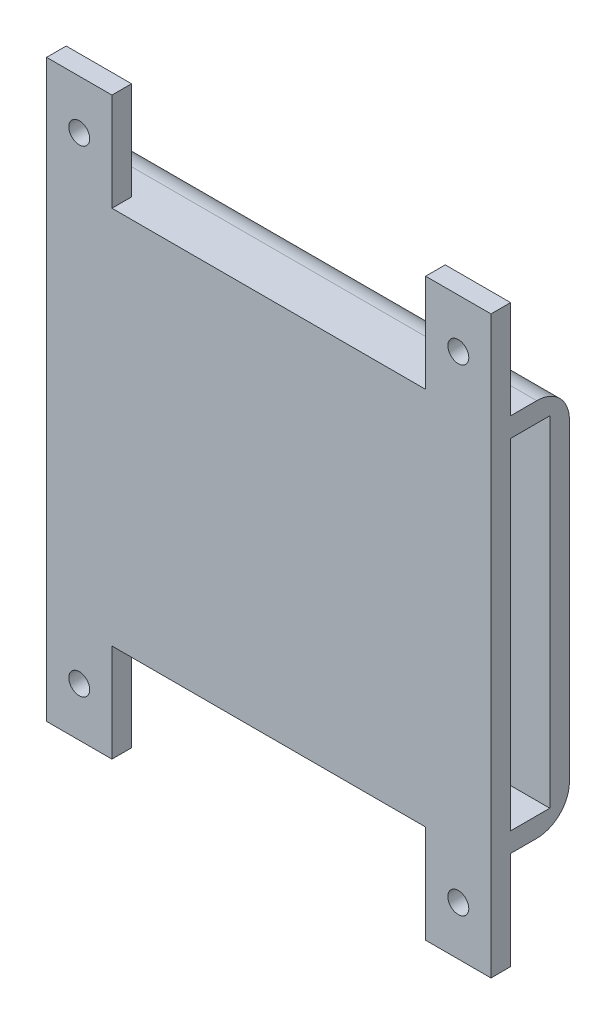
ISO-10303-21;
HEADER;
FILE_DESCRIPTION(('STEP AP214'),'2;1');
FILE_NAME('part.step','',(''),(''),'','','');
FILE_SCHEMA(('AUTOMOTIVE_DESIGN { 1 0 10303 214 1 1 1 1 }'));
ENDSEC;
DATA;
#1=APPLICATION_CONTEXT('core data for automotive mechanical design processes');
#2=APPLICATION_PROTOCOL_DEFINITION('international standard','automotive_design',2000,#1);
#3=PRODUCT_CONTEXT('',#1,'mechanical');
#4=PRODUCT('Part','Part','',(#3));
#5=PRODUCT_RELATED_PRODUCT_CATEGORY('part','',(#4));
#6=PRODUCT_DEFINITION_FORMATION('','',#4);
#7=PRODUCT_DEFINITION_CONTEXT('part definition',#1,'design');
#8=PRODUCT_DEFINITION('design','',#6,#7);
#9=PRODUCT_DEFINITION_SHAPE('','',#8);
#10=(LENGTH_UNIT() NAMED_UNIT(*) SI_UNIT(.MILLI.,.METRE.));
#11=(NAMED_UNIT(*) PLANE_ANGLE_UNIT() SI_UNIT($,.RADIAN.));
#12=(NAMED_UNIT(*) SI_UNIT($,.STERADIAN.) SOLID_ANGLE_UNIT());
#13=UNCERTAINTY_MEASURE_WITH_UNIT(LENGTH_MEASURE(1.E-05),#10,'distance_accuracy_value','');
#14=(GEOMETRIC_REPRESENTATION_CONTEXT(3) GLOBAL_UNCERTAINTY_ASSIGNED_CONTEXT((#13)) GLOBAL_UNIT_ASSIGNED_CONTEXT((#10,
#11,#12)) REPRESENTATION_CONTEXT('',''));
#15=CARTESIAN_POINT('',(0.,0.,0.));
#16=DIRECTION('',(0.,0.,1.));
#17=DIRECTION('',(1.,0.,0.));
#18=AXIS2_PLACEMENT_3D('',#15,#16,#17);
#19=CARTESIAN_POINT('',(-34.,-29.,3.));
#20=DIRECTION('',(0.,1.,0.));
#21=DIRECTION('',(0.,0.,1.));
#22=AXIS2_PLACEMENT_3D('',#19,#20,#21);
#23=PLANE('',#22);
#24=DIRECTION('',(0.,0.,-1.));
#25=VECTOR('',#24,1.);
#26=CARTESIAN_POINT('',(-34.,-29.,3.));
#27=LINE('',#26,#25);
#28=CARTESIAN_POINT('',(-34.,-29.,9.));
#29=VERTEX_POINT('',#28);
#30=CARTESIAN_POINT('',(-34.,-29.,5.));
#31=VERTEX_POINT('',#30);
#32=EDGE_CURVE('E354',#29,#31,#27,.T.);
#33=ORIENTED_EDGE('',*,*,#32,.T.);
#34=DIRECTION('',(1.,0.,0.));
#35=VECTOR('',#34,1.);
#36=CARTESIAN_POINT('',(-34.,-29.,5.));
#37=LINE('',#36,#35);
#38=CARTESIAN_POINT('',(34.,-29.,5.));
#39=VERTEX_POINT('',#38);
#40=EDGE_CURVE('E62',#31,#39,#37,.T.);
#41=ORIENTED_EDGE('',*,*,#40,.T.);
#42=DIRECTION('',(0.,0.,-1.));
#43=VECTOR('',#42,1.);
#44=CARTESIAN_POINT('',(34.,-29.,3.));
#45=LINE('',#44,#43);
#46=CARTESIAN_POINT('',(34.,-29.,9.));
#47=VERTEX_POINT('',#46);
#48=EDGE_CURVE('E351',#47,#39,#45,.T.);
#49=ORIENTED_EDGE('',*,*,#48,.F.);
#50=DIRECTION('',(1.,0.,0.));
#51=VECTOR('',#50,1.);
#52=CARTESIAN_POINT('',(34.,-29.,9.));
#53=LINE('',#52,#51);
#54=CARTESIAN_POINT('',(24.,-29.,9.));
#55=VERTEX_POINT('',#54);
#56=EDGE_CURVE('E281',#55,#47,#53,.T.);
#57=ORIENTED_EDGE('',*,*,#56,.F.);
#58=DIRECTION('',(0.,0.,-1.));
#59=VECTOR('',#58,1.);
#60=CARTESIAN_POINT('',(24.,-29.,12.));
#61=LINE('',#60,#59);
#62=CARTESIAN_POINT('',(24.,-29.,12.));
#63=VERTEX_POINT('',#62);
#64=EDGE_CURVE('E283',#63,#55,#61,.T.);
#65=ORIENTED_EDGE('',*,*,#64,.F.);
#66=DIRECTION('',(1.,0.,0.));
#67=VECTOR('',#66,1.);
#68=CARTESIAN_POINT('',(-34.,-29.,12.));
#69=LINE('',#68,#67);
#70=CARTESIAN_POINT('',(-24.,-29.,12.));
#71=VERTEX_POINT('',#70);
#72=EDGE_CURVE('E329',#71,#63,#69,.T.);
#73=ORIENTED_EDGE('',*,*,#72,.F.);
#74=DIRECTION('',(0.,0.,1.));
#75=VECTOR('',#74,1.);
#76=CARTESIAN_POINT('',(-24.,-29.,12.));
#77=LINE('',#76,#75);
#78=CARTESIAN_POINT('',(-24.,-29.,9.));
#79=VERTEX_POINT('',#78);
#80=EDGE_CURVE('E296',#79,#71,#77,.T.);
#81=ORIENTED_EDGE('',*,*,#80,.F.);
#82=DIRECTION('',(1.,0.,0.));
#83=VECTOR('',#82,1.);
#84=CARTESIAN_POINT('',(-34.,-29.,9.));
#85=LINE('',#84,#83);
#86=EDGE_CURVE('E285',#29,#79,#85,.T.);
#87=ORIENTED_EDGE('',*,*,#86,.F.);
#88=EDGE_LOOP('',(#33,#41,#49,#57,#65,#73,#81,#87));
#89=FACE_BOUND('',#88,.T.);
#90=ADVANCED_FACE('F37',(#89),#23,.F.);
#91=CARTESIAN_POINT('',(-31.,26.,12.));
#92=DIRECTION('',(0.,1.,0.));
#93=DIRECTION('',(0.,0.,1.));
#94=AXIS2_PLACEMENT_3D('',#91,#92,#93);
#95=PLANE('',#94);
#96=DIRECTION('',(-1.,0.,0.));
#97=VECTOR('',#96,1.);
#98=CARTESIAN_POINT('',(34.,26.,9.));
#99=LINE('',#98,#97);
#100=CARTESIAN_POINT('',(34.,26.,9.));
#101=VERTEX_POINT('',#100);
#102=CARTESIAN_POINT('',(-31.,26.,9.));
#103=VERTEX_POINT('',#102);
#104=EDGE_CURVE('E319',#101,#103,#99,.T.);
#105=ORIENTED_EDGE('',*,*,#104,.T.);
#106=DIRECTION('',(0.,0.,-1.));
#107=VECTOR('',#106,1.);
#108=CARTESIAN_POINT('',(-31.,26.,12.));
#109=LINE('',#108,#107);
#110=CARTESIAN_POINT('',(-31.,26.,3.));
#111=VERTEX_POINT('',#110);
#112=EDGE_CURVE('E332',#103,#111,#109,.T.);
#113=ORIENTED_EDGE('',*,*,#112,.T.);
#114=DIRECTION('',(1.,0.,0.));
#115=VECTOR('',#114,1.);
#116=CARTESIAN_POINT('',(-31.,26.,3.));
#117=LINE('',#116,#115);
#118=CARTESIAN_POINT('',(34.,26.,3.));
#119=VERTEX_POINT('',#118);
#120=EDGE_CURVE('E324',#111,#119,#117,.T.);
#121=ORIENTED_EDGE('',*,*,#120,.T.);
#122=DIRECTION('',(0.,0.,-1.));
#123=VECTOR('',#122,1.);
#124=CARTESIAN_POINT('',(34.,26.,12.));
#125=LINE('',#124,#123);
#126=EDGE_CURVE('E345',#101,#119,#125,.T.);
#127=ORIENTED_EDGE('',*,*,#126,.F.);
#128=EDGE_LOOP('',(#105,#113,#121,#127));
#129=FACE_BOUND('',#128,.T.);
#130=ADVANCED_FACE('F423',(#129),#95,.F.);
#131=CARTESIAN_POINT('',(34.,-26.,12.));
#132=DIRECTION('',(0.,-1.,0.));
#133=DIRECTION('',(1.,0.,0.));
#134=AXIS2_PLACEMENT_3D('',#131,#132,#133);
#135=PLANE('',#134);
#136=DIRECTION('',(-1.,0.,0.));
#137=VECTOR('',#136,1.);
#138=CARTESIAN_POINT('',(34.,-26.,8.99999999999999));
#139=LINE('',#138,#137);
#140=CARTESIAN_POINT('',(34.,-26.,8.99999999999999));
#141=VERTEX_POINT('',#140);
#142=CARTESIAN_POINT('',(-31.,-26.,8.99999999999999));
#143=VERTEX_POINT('',#142);
#144=EDGE_CURVE('E323',#141,#143,#139,.T.);
#145=ORIENTED_EDGE('',*,*,#144,.F.);
#146=DIRECTION('',(0.,0.,-1.));
#147=VECTOR('',#146,1.);
#148=CARTESIAN_POINT('',(34.,-26.,12.));
#149=LINE('',#148,#147);
#150=CARTESIAN_POINT('',(34.,-26.,3.));
#151=VERTEX_POINT('',#150);
#152=EDGE_CURVE('E343',#141,#151,#149,.T.);
#153=ORIENTED_EDGE('',*,*,#152,.T.);
#154=DIRECTION('',(-1.,0.,0.));
#155=VECTOR('',#154,1.);
#156=CARTESIAN_POINT('',(34.,-26.,3.));
#157=LINE('',#156,#155);
#158=CARTESIAN_POINT('',(-31.,-26.,3.));
#159=VERTEX_POINT('',#158);
#160=EDGE_CURVE('E335',#151,#159,#157,.T.);
#161=ORIENTED_EDGE('',*,*,#160,.T.);
#162=DIRECTION('',(0.,0.,-1.));
#163=VECTOR('',#162,1.);
#164=CARTESIAN_POINT('',(-31.,-26.,12.));
#165=LINE('',#164,#163);
#166=EDGE_CURVE('E341',#143,#159,#165,.T.);
#167=ORIENTED_EDGE('',*,*,#166,.F.);
#168=EDGE_LOOP('',(#145,#153,#161,#167));
#169=FACE_BOUND('',#168,.T.);
#170=ADVANCED_FACE('F428',(#169),#135,.F.);
#171=CARTESIAN_POINT('',(-31.,-26.,12.));
#172=DIRECTION('',(-1.,0.,0.));
#173=DIRECTION('',(0.,0.,1.));
#174=AXIS2_PLACEMENT_3D('',#171,#172,#173);
#175=PLANE('',#174);
#176=DIRECTION('',(0.,1.,0.));
#177=VECTOR('',#176,1.);
#178=CARTESIAN_POINT('',(-31.,26.,9.));
#179=LINE('',#178,#177);
#180=EDGE_CURVE('E316',#143,#103,#179,.T.);
#181=ORIENTED_EDGE('',*,*,#180,.F.);
#182=ORIENTED_EDGE('',*,*,#166,.T.);
#183=DIRECTION('',(0.,1.,0.));
#184=VECTOR('',#183,1.);
#185=CARTESIAN_POINT('',(-31.,-26.,3.));
#186=LINE('',#185,#184);
#187=EDGE_CURVE('E204',#159,#111,#186,.T.);
#188=ORIENTED_EDGE('',*,*,#187,.T.);
#189=ORIENTED_EDGE('',*,*,#112,.F.);
#190=EDGE_LOOP('',(#181,#182,#188,#189));
#191=FACE_BOUND('',#190,.T.);
#192=ADVANCED_FACE('F440',(#191),#175,.F.);
#193=CARTESIAN_POINT('',(34.,29.,3.));
#194=DIRECTION('',(-1.,0.,0.));
#195=DIRECTION('',(0.,-1.,0.));
#196=AXIS2_PLACEMENT_3D('',#193,#194,#195);
#197=PLANE('',#196);
#198=DIRECTION('',(0.,1.,0.));
#199=VECTOR('',#198,1.);
#200=CARTESIAN_POINT('',(34.,26.,9.));
#201=LINE('',#200,#199);
#202=EDGE_CURVE('E317',#141,#101,#201,.T.);
#203=ORIENTED_EDGE('',*,*,#202,.T.);
#204=ORIENTED_EDGE('',*,*,#126,.T.);
#205=DIRECTION('',(0.,1.,0.));
#206=VECTOR('',#205,1.);
#207=CARTESIAN_POINT('',(34.,29.,3.));
#208=LINE('',#207,#206);
#209=EDGE_CURVE('E348',#151,#119,#208,.T.);
#210=ORIENTED_EDGE('',*,*,#209,.F.);
#211=ORIENTED_EDGE('',*,*,#152,.F.);
#212=EDGE_LOOP('',(#203,#204,#210,#211));
#213=FACE_BOUND('',#212,.T.);
#214=ORIENTED_EDGE('',*,*,#48,.T.);
#215=CARTESIAN_POINT('',(34.,-24.,5.));
#216=DIRECTION('',(-1.,0.,0.));
#217=DIRECTION('',(0.,-1.,0.));
#218=AXIS2_PLACEMENT_3D('',#215,#216,#217);
#219=CIRCLE('',#218,5.);
#220=CARTESIAN_POINT('',(34.,-24.,0.));
#221=VERTEX_POINT('',#220);
#222=EDGE_CURVE('E46',#39,#221,#219,.F.);
#223=ORIENTED_EDGE('',*,*,#222,.T.);
#224=DIRECTION('',(0.,1.,0.));
#225=VECTOR('',#224,1.);
#226=CARTESIAN_POINT('',(34.,29.,0.));
#227=LINE('',#226,#225);
#228=CARTESIAN_POINT('',(34.,24.,0.));
#229=VERTEX_POINT('',#228);
#230=EDGE_CURVE('E347',#221,#229,#227,.T.);
#231=ORIENTED_EDGE('',*,*,#230,.T.);
#232=CARTESIAN_POINT('',(34.,24.,5.));
#233=DIRECTION('',(-1.,0.,0.));
#234=DIRECTION('',(0.,-1.,0.));
#235=AXIS2_PLACEMENT_3D('',#232,#233,#234);
#236=CIRCLE('',#235,5.);
#237=CARTESIAN_POINT('',(34.,29.,5.));
#238=VERTEX_POINT('',#237);
#239=EDGE_CURVE('E54',#229,#238,#236,.F.);
#240=ORIENTED_EDGE('',*,*,#239,.T.);
#241=DIRECTION('',(0.,0.,-1.));
#242=VECTOR('',#241,1.);
#243=CARTESIAN_POINT('',(34.,29.,3.));
#244=LINE('',#243,#242);
#245=CARTESIAN_POINT('',(34.,29.,9.));
#246=VERTEX_POINT('',#245);
#247=EDGE_CURVE('E359',#246,#238,#244,.T.);
#248=ORIENTED_EDGE('',*,*,#247,.F.);
#249=DIRECTION('',(0.,-1.,0.));
#250=VECTOR('',#249,1.);
#251=CARTESIAN_POINT('',(34.,44.,9.));
#252=LINE('',#251,#250);
#253=CARTESIAN_POINT('',(34.,44.,9.));
#254=VERTEX_POINT('',#253);
#255=EDGE_CURVE('E217',#254,#246,#252,.T.);
#256=ORIENTED_EDGE('',*,*,#255,.F.);
#257=DIRECTION('',(0.,0.,1.));
#258=VECTOR('',#257,1.);
#259=CARTESIAN_POINT('',(34.,44.,12.));
#260=LINE('',#259,#258);
#261=CARTESIAN_POINT('',(34.,44.,12.));
#262=VERTEX_POINT('',#261);
#263=EDGE_CURVE('E210',#254,#262,#260,.T.);
#264=ORIENTED_EDGE('',*,*,#263,.T.);
#265=DIRECTION('',(0.,1.,0.));
#266=VECTOR('',#265,1.);
#267=CARTESIAN_POINT('',(34.,26.,12.));
#268=LINE('',#267,#266);
#269=CARTESIAN_POINT('',(34.,-44.,12.));
#270=VERTEX_POINT('',#269);
#271=EDGE_CURVE('E191',#270,#262,#268,.T.);
#272=ORIENTED_EDGE('',*,*,#271,.F.);
#273=DIRECTION('',(0.,0.,1.));
#274=VECTOR('',#273,1.);
#275=CARTESIAN_POINT('',(34.,-44.,12.));
#276=LINE('',#275,#274);
#277=CARTESIAN_POINT('',(34.,-44.,9.));
#278=VERTEX_POINT('',#277);
#279=EDGE_CURVE('E280',#278,#270,#276,.T.);
#280=ORIENTED_EDGE('',*,*,#279,.F.);
#281=DIRECTION('',(0.,1.,0.));
#282=VECTOR('',#281,1.);
#283=CARTESIAN_POINT('',(34.,-44.,9.));
#284=LINE('',#283,#282);
#285=EDGE_CURVE('E277',#278,#47,#284,.T.);
#286=ORIENTED_EDGE('',*,*,#285,.T.);
#287=EDGE_LOOP('',(#214,#223,#231,#240,#248,#256,#264,#272,#280,#286));
#288=FACE_BOUND('',#287,.T.);
#289=ADVANCED_FACE('F216',(#213,#288),#197,.F.);
#290=CARTESIAN_POINT('',(-34.,29.,3.));
#291=DIRECTION('',(0.,-1.,0.));
#292=DIRECTION('',(0.,0.,-1.));
#293=AXIS2_PLACEMENT_3D('',#290,#291,#292);
#294=PLANE('',#293);
#295=ORIENTED_EDGE('',*,*,#247,.T.);
#296=DIRECTION('',(-1.,0.,0.));
#297=VECTOR('',#296,1.);
#298=CARTESIAN_POINT('',(-34.,29.,5.));
#299=LINE('',#298,#297);
#300=CARTESIAN_POINT('',(-34.,29.,5.));
#301=VERTEX_POINT('',#300);
#302=EDGE_CURVE('E11',#238,#301,#299,.T.);
#303=ORIENTED_EDGE('',*,*,#302,.T.);
#304=DIRECTION('',(0.,0.,-1.));
#305=VECTOR('',#304,1.);
#306=CARTESIAN_POINT('',(-34.,29.,3.));
#307=LINE('',#306,#305);
#308=CARTESIAN_POINT('',(-34.,29.,9.));
#309=VERTEX_POINT('',#308);
#310=EDGE_CURVE('E356',#309,#301,#307,.T.);
#311=ORIENTED_EDGE('',*,*,#310,.F.);
#312=DIRECTION('',(1.,0.,0.));
#313=VECTOR('',#312,1.);
#314=CARTESIAN_POINT('',(-34.,29.,9.));
#315=LINE('',#314,#313);
#316=CARTESIAN_POINT('',(-24.,29.,9.));
#317=VERTEX_POINT('',#316);
#318=EDGE_CURVE('E240',#309,#317,#315,.T.);
#319=ORIENTED_EDGE('',*,*,#318,.T.);
#320=DIRECTION('',(0.,0.,1.));
#321=VECTOR('',#320,1.);
#322=CARTESIAN_POINT('',(-24.,29.,12.));
#323=LINE('',#322,#321);
#324=CARTESIAN_POINT('',(-24.,29.,12.));
#325=VERTEX_POINT('',#324);
#326=EDGE_CURVE('E235',#317,#325,#323,.T.);
#327=ORIENTED_EDGE('',*,*,#326,.T.);
#328=DIRECTION('',(-1.,0.,0.));
#329=VECTOR('',#328,1.);
#330=CARTESIAN_POINT('',(34.,29.,12.));
#331=LINE('',#330,#329);
#332=CARTESIAN_POINT('',(24.,29.,12.));
#333=VERTEX_POINT('',#332);
#334=EDGE_CURVE('E203',#333,#325,#331,.T.);
#335=ORIENTED_EDGE('',*,*,#334,.F.);
#336=DIRECTION('',(0.,0.,-1.));
#337=VECTOR('',#336,1.);
#338=CARTESIAN_POINT('',(24.,29.,12.));
#339=LINE('',#338,#337);
#340=CARTESIAN_POINT('',(24.,29.,9.));
#341=VERTEX_POINT('',#340);
#342=EDGE_CURVE('E214',#333,#341,#339,.T.);
#343=ORIENTED_EDGE('',*,*,#342,.T.);
#344=DIRECTION('',(1.,0.,0.));
#345=VECTOR('',#344,1.);
#346=CARTESIAN_POINT('',(34.,29.,9.));
#347=LINE('',#346,#345);
#348=EDGE_CURVE('E225',#341,#246,#347,.T.);
#349=ORIENTED_EDGE('',*,*,#348,.T.);
#350=EDGE_LOOP('',(#295,#303,#311,#319,#327,#335,#343,#349));
#351=FACE_BOUND('',#350,.T.);
#352=ADVANCED_FACE('F406',(#351),#294,.F.);
#353=CARTESIAN_POINT('',(-34.,29.,3.));
#354=DIRECTION('',(1.,0.,0.));
#355=DIRECTION('',(0.,1.,0.));
#356=AXIS2_PLACEMENT_3D('',#353,#354,#355);
#357=PLANE('',#356);
#358=ORIENTED_EDGE('',*,*,#310,.T.);
#359=DIRECTION('',(0.,-1.,0.));
#360=VECTOR('',#359,1.);
#361=CARTESIAN_POINT('',(-34.,29.,5.));
#362=LINE('',#361,#360);
#363=EDGE_CURVE('E361',#301,#31,#362,.T.);
#364=ORIENTED_EDGE('',*,*,#363,.T.);
#365=ORIENTED_EDGE('',*,*,#32,.F.);
#366=DIRECTION('',(0.,1.,0.));
#367=VECTOR('',#366,1.);
#368=CARTESIAN_POINT('',(-34.,-44.,9.));
#369=LINE('',#368,#367);
#370=CARTESIAN_POINT('',(-34.,-44.,9.));
#371=VERTEX_POINT('',#370);
#372=EDGE_CURVE('E313',#371,#29,#369,.T.);
#373=ORIENTED_EDGE('',*,*,#372,.F.);
#374=DIRECTION('',(0.,0.,-1.));
#375=VECTOR('',#374,1.);
#376=CARTESIAN_POINT('',(-34.,-44.,12.));
#377=LINE('',#376,#375);
#378=CARTESIAN_POINT('',(-34.,-44.,12.));
#379=VERTEX_POINT('',#378);
#380=EDGE_CURVE('E292',#379,#371,#377,.T.);
#381=ORIENTED_EDGE('',*,*,#380,.F.);
#382=DIRECTION('',(0.,-1.,0.));
#383=VECTOR('',#382,1.);
#384=CARTESIAN_POINT('',(-34.,29.,12.));
#385=LINE('',#384,#383);
#386=CARTESIAN_POINT('',(-34.,44.,12.));
#387=VERTEX_POINT('',#386);
#388=EDGE_CURVE('E327',#387,#379,#385,.T.);
#389=ORIENTED_EDGE('',*,*,#388,.F.);
#390=DIRECTION('',(0.,0.,-1.));
#391=VECTOR('',#390,1.);
#392=CARTESIAN_POINT('',(-34.,44.,12.));
#393=LINE('',#392,#391);
#394=CARTESIAN_POINT('',(-34.,44.,9.));
#395=VERTEX_POINT('',#394);
#396=EDGE_CURVE('E236',#387,#395,#393,.T.);
#397=ORIENTED_EDGE('',*,*,#396,.T.);
#398=DIRECTION('',(0.,-1.,0.));
#399=VECTOR('',#398,1.);
#400=CARTESIAN_POINT('',(-34.,44.,9.));
#401=LINE('',#400,#399);
#402=EDGE_CURVE('E249',#395,#309,#401,.T.);
#403=ORIENTED_EDGE('',*,*,#402,.T.);
#404=EDGE_LOOP('',(#358,#364,#365,#373,#381,#389,#397,#403));
#405=FACE_BOUND('',#404,.T.);
#406=ADVANCED_FACE('F409',(#405),#357,.F.);
#407=CARTESIAN_POINT('',(0.,0.,3.));
#408=DIRECTION('',(0.,0.,1.));
#409=DIRECTION('',(1.,0.,0.));
#410=AXIS2_PLACEMENT_3D('',#407,#408,#409);
#411=PLANE('',#410);
#412=ORIENTED_EDGE('',*,*,#120,.F.);
#413=ORIENTED_EDGE('',*,*,#187,.F.);
#414=ORIENTED_EDGE('',*,*,#160,.F.);
#415=ORIENTED_EDGE('',*,*,#209,.T.);
#416=EDGE_LOOP('',(#412,#413,#414,#415));
#417=FACE_BOUND('',#416,.T.);
#418=ADVANCED_FACE('F437',(#417),#411,.T.);
#419=CARTESIAN_POINT('',(0.,0.,0.));
#420=DIRECTION('',(0.,0.,1.));
#421=DIRECTION('',(1.,0.,0.));
#422=AXIS2_PLACEMENT_3D('',#419,#420,#421);
#423=PLANE('',#422);
#424=ORIENTED_EDGE('',*,*,#230,.F.);
#425=DIRECTION('',(1.,0.,0.));
#426=VECTOR('',#425,1.);
#427=CARTESIAN_POINT('',(0.,-24.,0.));
#428=LINE('',#427,#426);
#429=CARTESIAN_POINT('',(-29.,-24.,0.));
#430=VERTEX_POINT('',#429);
#431=EDGE_CURVE('E368',#221,#430,#428,.F.);
#432=ORIENTED_EDGE('',*,*,#431,.T.);
#433=DIRECTION('',(0.,-1.,0.));
#434=VECTOR('',#433,1.);
#435=CARTESIAN_POINT('',(-29.,0.,0.));
#436=LINE('',#435,#434);
#437=CARTESIAN_POINT('',(-29.,24.,0.));
#438=VERTEX_POINT('',#437);
#439=EDGE_CURVE('E366',#430,#438,#436,.F.);
#440=ORIENTED_EDGE('',*,*,#439,.T.);
#441=DIRECTION('',(-1.,0.,0.));
#442=VECTOR('',#441,1.);
#443=CARTESIAN_POINT('',(0.,24.,0.));
#444=LINE('',#443,#442);
#445=EDGE_CURVE('E364',#438,#229,#444,.F.);
#446=ORIENTED_EDGE('',*,*,#445,.T.);
#447=EDGE_LOOP('',(#424,#432,#440,#446));
#448=FACE_BOUND('',#447,.T.);
#449=ADVANCED_FACE('F433',(#448),#423,.F.);
#450=CARTESIAN_POINT('',(0.,0.,12.));
#451=DIRECTION('',(0.,0.,1.));
#452=DIRECTION('',(1.,0.,0.));
#453=AXIS2_PLACEMENT_3D('',#450,#451,#452);
#454=PLANE('',#453);
#455=CARTESIAN_POINT('',(-29.,36.5,12.));
#456=DIRECTION('',(0.,0.,-1.));
#457=DIRECTION('',(1.,0.,0.));
#458=AXIS2_PLACEMENT_3D('',#455,#456,#457);
#459=CIRCLE('',#458,1.6);
#460=CARTESIAN_POINT('',(-27.4,36.5,12.));
#461=VERTEX_POINT('',#460);
#462=EDGE_CURVE('E385',#461,#461,#459,.T.);
#463=ORIENTED_EDGE('',*,*,#462,.T.);
#464=EDGE_LOOP('',(#463));
#465=FACE_BOUND('',#464,.T.);
#466=CARTESIAN_POINT('',(29.,36.5,12.));
#467=DIRECTION('',(0.,0.,-1.));
#468=DIRECTION('',(-1.,0.,0.));
#469=AXIS2_PLACEMENT_3D('',#466,#467,#468);
#470=CIRCLE('',#469,1.6);
#471=CARTESIAN_POINT('',(27.4,36.5,12.));
#472=VERTEX_POINT('',#471);
#473=EDGE_CURVE('E378',#472,#472,#470,.T.);
#474=ORIENTED_EDGE('',*,*,#473,.T.);
#475=EDGE_LOOP('',(#474));
#476=FACE_BOUND('',#475,.T.);
#477=CARTESIAN_POINT('',(-29.,-36.5,12.));
#478=DIRECTION('',(0.,0.,1.));
#479=DIRECTION('',(1.,0.,0.));
#480=AXIS2_PLACEMENT_3D('',#477,#478,#479);
#481=CIRCLE('',#480,1.6);
#482=CARTESIAN_POINT('',(-27.4,-36.5,12.));
#483=VERTEX_POINT('',#482);
#484=EDGE_CURVE('E265',#483,#483,#481,.T.);
#485=ORIENTED_EDGE('',*,*,#484,.F.);
#486=EDGE_LOOP('',(#485));
#487=FACE_BOUND('',#486,.T.);
#488=CARTESIAN_POINT('',(29.,-36.5,12.));
#489=DIRECTION('',(0.,0.,1.));
#490=DIRECTION('',(-1.,0.,0.));
#491=AXIS2_PLACEMENT_3D('',#488,#489,#490);
#492=CIRCLE('',#491,1.6);
#493=CARTESIAN_POINT('',(27.4,-36.5,12.));
#494=VERTEX_POINT('',#493);
#495=EDGE_CURVE('E268',#494,#494,#492,.T.);
#496=ORIENTED_EDGE('',*,*,#495,.F.);
#497=EDGE_LOOP('',(#496));
#498=FACE_BOUND('',#497,.T.);
#499=ORIENTED_EDGE('',*,*,#388,.T.);
#500=DIRECTION('',(-1.,0.,0.));
#501=VECTOR('',#500,1.);
#502=CARTESIAN_POINT('',(-34.,-44.,12.));
#503=LINE('',#502,#501);
#504=CARTESIAN_POINT('',(-24.,-44.,12.));
#505=VERTEX_POINT('',#504);
#506=EDGE_CURVE('E300',#505,#379,#503,.T.);
#507=ORIENTED_EDGE('',*,*,#506,.F.);
#508=DIRECTION('',(0.,1.,0.));
#509=VECTOR('',#508,1.);
#510=CARTESIAN_POINT('',(-24.,-44.,12.));
#511=LINE('',#510,#509);
#512=EDGE_CURVE('E303',#505,#71,#511,.T.);
#513=ORIENTED_EDGE('',*,*,#512,.T.);
#514=ORIENTED_EDGE('',*,*,#72,.T.);
#515=DIRECTION('',(0.,1.,0.));
#516=VECTOR('',#515,1.);
#517=CARTESIAN_POINT('',(24.,-44.,12.));
#518=LINE('',#517,#516);
#519=CARTESIAN_POINT('',(24.,-44.,12.));
#520=VERTEX_POINT('',#519);
#521=EDGE_CURVE('E264',#520,#63,#518,.T.);
#522=ORIENTED_EDGE('',*,*,#521,.F.);
#523=DIRECTION('',(-1.,0.,0.));
#524=VECTOR('',#523,1.);
#525=CARTESIAN_POINT('',(34.,-44.,12.));
#526=LINE('',#525,#524);
#527=EDGE_CURVE('E199',#270,#520,#526,.T.);
#528=ORIENTED_EDGE('',*,*,#527,.F.);
#529=ORIENTED_EDGE('',*,*,#271,.T.);
#530=DIRECTION('',(-1.,0.,0.));
#531=VECTOR('',#530,1.);
#532=CARTESIAN_POINT('',(34.,44.,12.));
#533=LINE('',#532,#531);
#534=CARTESIAN_POINT('',(24.,44.,12.));
#535=VERTEX_POINT('',#534);
#536=EDGE_CURVE('E195',#262,#535,#533,.T.);
#537=ORIENTED_EDGE('',*,*,#536,.T.);
#538=DIRECTION('',(0.,-1.,0.));
#539=VECTOR('',#538,1.);
#540=CARTESIAN_POINT('',(24.,44.,12.));
#541=LINE('',#540,#539);
#542=EDGE_CURVE('E224',#535,#333,#541,.T.);
#543=ORIENTED_EDGE('',*,*,#542,.T.);
#544=ORIENTED_EDGE('',*,*,#334,.T.);
#545=DIRECTION('',(0.,-1.,0.));
#546=VECTOR('',#545,1.);
#547=CARTESIAN_POINT('',(-24.,44.,12.));
#548=LINE('',#547,#546);
#549=CARTESIAN_POINT('',(-24.,44.,12.));
#550=VERTEX_POINT('',#549);
#551=EDGE_CURVE('E257',#550,#325,#548,.T.);
#552=ORIENTED_EDGE('',*,*,#551,.F.);
#553=DIRECTION('',(-1.,0.,0.));
#554=VECTOR('',#553,1.);
#555=CARTESIAN_POINT('',(-34.,44.,12.));
#556=LINE('',#555,#554);
#557=EDGE_CURVE('E239',#550,#387,#556,.T.);
#558=ORIENTED_EDGE('',*,*,#557,.T.);
#559=EDGE_LOOP('',(#499,#507,#513,#514,#522,#528,#529,#537,#543,#544,#552,#558));
#560=FACE_BOUND('',#559,.T.);
#561=ADVANCED_FACE('F193',(#465,#476,#487,#498,#560),#454,.T.);
#562=CARTESIAN_POINT('',(34.,26.,9.));
#563=DIRECTION('',(0.,0.,1.));
#564=DIRECTION('',(0.,-1.,0.));
#565=AXIS2_PLACEMENT_3D('',#562,#563,#564);
#566=PLANE('',#565);
#567=ORIENTED_EDGE('',*,*,#180,.T.);
#568=ORIENTED_EDGE('',*,*,#104,.F.);
#569=ORIENTED_EDGE('',*,*,#202,.F.);
#570=ORIENTED_EDGE('',*,*,#144,.T.);
#571=EDGE_LOOP('',(#567,#568,#569,#570));
#572=FACE_BOUND('',#571,.T.);
#573=ADVANCED_FACE('F453',(#572),#566,.F.);
#574=CARTESIAN_POINT('',(-34.,-44.,9.));
#575=DIRECTION('',(0.,0.,1.));
#576=DIRECTION('',(1.,0.,0.));
#577=AXIS2_PLACEMENT_3D('',#574,#575,#576);
#578=PLANE('',#577);
#579=CARTESIAN_POINT('',(-29.,-36.5,9.));
#580=DIRECTION('',(0.,0.,1.));
#581=DIRECTION('',(1.,0.,0.));
#582=AXIS2_PLACEMENT_3D('',#579,#580,#581);
#583=CIRCLE('',#582,1.6);
#584=CARTESIAN_POINT('',(-27.4,-36.5,9.));
#585=VERTEX_POINT('',#584);
#586=EDGE_CURVE('E261',#585,#585,#583,.T.);
#587=ORIENTED_EDGE('',*,*,#586,.T.);
#588=EDGE_LOOP('',(#587));
#589=FACE_BOUND('',#588,.T.);
#590=ORIENTED_EDGE('',*,*,#86,.T.);
#591=DIRECTION('',(0.,1.,0.));
#592=VECTOR('',#591,1.);
#593=CARTESIAN_POINT('',(-24.,-44.,9.));
#594=LINE('',#593,#592);
#595=CARTESIAN_POINT('',(-24.,-44.,9.));
#596=VERTEX_POINT('',#595);
#597=EDGE_CURVE('E310',#596,#79,#594,.T.);
#598=ORIENTED_EDGE('',*,*,#597,.F.);
#599=DIRECTION('',(1.,0.,0.));
#600=VECTOR('',#599,1.);
#601=CARTESIAN_POINT('',(-34.,-44.,9.));
#602=LINE('',#601,#600);
#603=EDGE_CURVE('E295',#371,#596,#602,.T.);
#604=ORIENTED_EDGE('',*,*,#603,.F.);
#605=ORIENTED_EDGE('',*,*,#372,.T.);
#606=EDGE_LOOP('',(#590,#598,#604,#605));
#607=FACE_BOUND('',#606,.T.);
#608=ADVANCED_FACE('F495',(#589,#607),#578,.F.);
#609=CARTESIAN_POINT('',(-24.,-44.,12.));
#610=DIRECTION('',(-1.,0.,0.));
#611=DIRECTION('',(0.,0.,1.));
#612=AXIS2_PLACEMENT_3D('',#609,#610,#611);
#613=PLANE('',#612);
#614=ORIENTED_EDGE('',*,*,#80,.T.);
#615=ORIENTED_EDGE('',*,*,#512,.F.);
#616=DIRECTION('',(0.,0.,1.));
#617=VECTOR('',#616,1.);
#618=CARTESIAN_POINT('',(-24.,-44.,12.));
#619=LINE('',#618,#617);
#620=EDGE_CURVE('E298',#596,#505,#619,.T.);
#621=ORIENTED_EDGE('',*,*,#620,.F.);
#622=ORIENTED_EDGE('',*,*,#597,.T.);
#623=EDGE_LOOP('',(#614,#615,#621,#622));
#624=FACE_BOUND('',#623,.T.);
#625=ADVANCED_FACE('F491',(#624),#613,.F.);
#626=CARTESIAN_POINT('',(0.,-44.,0.));
#627=DIRECTION('',(0.,-1.,0.));
#628=DIRECTION('',(0.,0.,-1.));
#629=AXIS2_PLACEMENT_3D('',#626,#627,#628);
#630=PLANE('',#629);
#631=ORIENTED_EDGE('',*,*,#380,.T.);
#632=ORIENTED_EDGE('',*,*,#603,.T.);
#633=ORIENTED_EDGE('',*,*,#620,.T.);
#634=ORIENTED_EDGE('',*,*,#506,.T.);
#635=EDGE_LOOP('',(#631,#632,#633,#634));
#636=FACE_BOUND('',#635,.T.);
#637=ADVANCED_FACE('F500',(#636),#630,.T.);
#638=CARTESIAN_POINT('',(24.,-44.,12.));
#639=DIRECTION('',(1.,0.,0.));
#640=DIRECTION('',(0.,0.,-1.));
#641=AXIS2_PLACEMENT_3D('',#638,#639,#640);
#642=PLANE('',#641);
#643=ORIENTED_EDGE('',*,*,#64,.T.);
#644=DIRECTION('',(0.,1.,0.));
#645=VECTOR('',#644,1.);
#646=CARTESIAN_POINT('',(24.,-44.,9.));
#647=LINE('',#646,#645);
#648=CARTESIAN_POINT('',(24.,-44.,9.));
#649=VERTEX_POINT('',#648);
#650=EDGE_CURVE('E274',#649,#55,#647,.T.);
#651=ORIENTED_EDGE('',*,*,#650,.F.);
#652=DIRECTION('',(0.,0.,-1.));
#653=VECTOR('',#652,1.);
#654=CARTESIAN_POINT('',(24.,-44.,12.));
#655=LINE('',#654,#653);
#656=EDGE_CURVE('E289',#520,#649,#655,.T.);
#657=ORIENTED_EDGE('',*,*,#656,.F.);
#658=ORIENTED_EDGE('',*,*,#521,.T.);
#659=EDGE_LOOP('',(#643,#651,#657,#658));
#660=FACE_BOUND('',#659,.T.);
#661=ADVANCED_FACE('F487',(#660),#642,.F.);
#662=CARTESIAN_POINT('',(34.,-44.,9.));
#663=DIRECTION('',(0.,0.,1.));
#664=DIRECTION('',(1.,0.,0.));
#665=AXIS2_PLACEMENT_3D('',#662,#663,#664);
#666=PLANE('',#665);
#667=CARTESIAN_POINT('',(29.,-36.5,9.));
#668=DIRECTION('',(0.,0.,1.));
#669=DIRECTION('',(-1.,0.,0.));
#670=AXIS2_PLACEMENT_3D('',#667,#668,#669);
#671=CIRCLE('',#670,1.6);
#672=CARTESIAN_POINT('',(27.4,-36.5,9.));
#673=VERTEX_POINT('',#672);
#674=EDGE_CURVE('E260',#673,#673,#671,.T.);
#675=ORIENTED_EDGE('',*,*,#674,.T.);
#676=EDGE_LOOP('',(#675));
#677=FACE_BOUND('',#676,.T.);
#678=ORIENTED_EDGE('',*,*,#56,.T.);
#679=ORIENTED_EDGE('',*,*,#285,.F.);
#680=DIRECTION('',(1.,0.,0.));
#681=VECTOR('',#680,1.);
#682=CARTESIAN_POINT('',(34.,-44.,9.));
#683=LINE('',#682,#681);
#684=EDGE_CURVE('E287',#649,#278,#683,.T.);
#685=ORIENTED_EDGE('',*,*,#684,.F.);
#686=ORIENTED_EDGE('',*,*,#650,.T.);
#687=EDGE_LOOP('',(#678,#679,#685,#686));
#688=FACE_BOUND('',#687,.T.);
#689=ADVANCED_FACE('F483',(#677,#688),#666,.F.);
#690=CARTESIAN_POINT('',(0.,-44.,0.));
#691=DIRECTION('',(0.,-1.,0.));
#692=DIRECTION('',(0.,0.,-1.));
#693=AXIS2_PLACEMENT_3D('',#690,#691,#692);
#694=PLANE('',#693);
#695=ORIENTED_EDGE('',*,*,#527,.T.);
#696=ORIENTED_EDGE('',*,*,#656,.T.);
#697=ORIENTED_EDGE('',*,*,#684,.T.);
#698=ORIENTED_EDGE('',*,*,#279,.T.);
#699=EDGE_LOOP('',(#695,#696,#697,#698));
#700=FACE_BOUND('',#699,.T.);
#701=ADVANCED_FACE('F533',(#700),#694,.T.);
#702=CARTESIAN_POINT('',(29.,-36.5,9.));
#703=DIRECTION('',(0.,0.,1.));
#704=DIRECTION('',(1.,0.,0.));
#705=AXIS2_PLACEMENT_3D('',#702,#703,#704);
#706=CYLINDRICAL_SURFACE('',#705,1.6);
#707=ORIENTED_EDGE('',*,*,#674,.F.);
#708=EDGE_LOOP('',(#707));
#709=FACE_BOUND('',#708,.T.);
#710=ORIENTED_EDGE('',*,*,#495,.T.);
#711=EDGE_LOOP('',(#710));
#712=FACE_BOUND('',#711,.T.);
#713=ADVANCED_FACE('F529',(#709,#712),#706,.F.);
#714=CARTESIAN_POINT('',(-29.,-36.5,9.));
#715=DIRECTION('',(0.,0.,1.));
#716=DIRECTION('',(1.,0.,0.));
#717=AXIS2_PLACEMENT_3D('',#714,#715,#716);
#718=CYLINDRICAL_SURFACE('',#717,1.6);
#719=ORIENTED_EDGE('',*,*,#586,.F.);
#720=EDGE_LOOP('',(#719));
#721=FACE_BOUND('',#720,.T.);
#722=ORIENTED_EDGE('',*,*,#484,.T.);
#723=EDGE_LOOP('',(#722));
#724=FACE_BOUND('',#723,.T.);
#725=ADVANCED_FACE('F526',(#721,#724),#718,.F.);
#726=CARTESIAN_POINT('',(-24.,44.,12.));
#727=DIRECTION('',(1.,0.,0.));
#728=DIRECTION('',(0.,0.,-1.));
#729=AXIS2_PLACEMENT_3D('',#726,#727,#728);
#730=PLANE('',#729);
#731=ORIENTED_EDGE('',*,*,#326,.F.);
#732=DIRECTION('',(0.,-1.,0.));
#733=VECTOR('',#732,1.);
#734=CARTESIAN_POINT('',(-24.,44.,9.));
#735=LINE('',#734,#733);
#736=CARTESIAN_POINT('',(-24.,44.,9.));
#737=VERTEX_POINT('',#736);
#738=EDGE_CURVE('E255',#737,#317,#735,.T.);
#739=ORIENTED_EDGE('',*,*,#738,.F.);
#740=DIRECTION('',(0.,0.,1.));
#741=VECTOR('',#740,1.);
#742=CARTESIAN_POINT('',(-24.,44.,12.));
#743=LINE('',#742,#741);
#744=EDGE_CURVE('E243',#737,#550,#743,.T.);
#745=ORIENTED_EDGE('',*,*,#744,.T.);
#746=ORIENTED_EDGE('',*,*,#551,.T.);
#747=EDGE_LOOP('',(#731,#739,#745,#746));
#748=FACE_BOUND('',#747,.T.);
#749=ADVANCED_FACE('F400',(#748),#730,.T.);
#750=CARTESIAN_POINT('',(-34.,44.,9.));
#751=DIRECTION('',(0.,0.,-1.));
#752=DIRECTION('',(-1.,0.,0.));
#753=AXIS2_PLACEMENT_3D('',#750,#751,#752);
#754=PLANE('',#753);
#755=CARTESIAN_POINT('',(-29.,36.5,9.));
#756=DIRECTION('',(0.,0.,-1.));
#757=DIRECTION('',(1.,0.,0.));
#758=AXIS2_PLACEMENT_3D('',#755,#756,#757);
#759=CIRCLE('',#758,1.6);
#760=CARTESIAN_POINT('',(-27.4,36.5,9.));
#761=VERTEX_POINT('',#760);
#762=EDGE_CURVE('E228',#761,#761,#759,.T.);
#763=ORIENTED_EDGE('',*,*,#762,.F.);
#764=EDGE_LOOP('',(#763));
#765=FACE_BOUND('',#764,.T.);
#766=ORIENTED_EDGE('',*,*,#318,.F.);
#767=ORIENTED_EDGE('',*,*,#402,.F.);
#768=DIRECTION('',(1.,0.,0.));
#769=VECTOR('',#768,1.);
#770=CARTESIAN_POINT('',(-34.,44.,9.));
#771=LINE('',#770,#769);
#772=EDGE_CURVE('E246',#395,#737,#771,.T.);
#773=ORIENTED_EDGE('',*,*,#772,.T.);
#774=ORIENTED_EDGE('',*,*,#738,.T.);
#775=EDGE_LOOP('',(#766,#767,#773,#774));
#776=FACE_BOUND('',#775,.T.);
#777=ADVANCED_FACE('F396',(#765,#776),#754,.T.);
#778=CARTESIAN_POINT('',(0.,44.,0.));
#779=DIRECTION('',(0.,1.,0.));
#780=DIRECTION('',(0.,0.,-1.));
#781=AXIS2_PLACEMENT_3D('',#778,#779,#780);
#782=PLANE('',#781);
#783=ORIENTED_EDGE('',*,*,#396,.F.);
#784=ORIENTED_EDGE('',*,*,#557,.F.);
#785=ORIENTED_EDGE('',*,*,#744,.F.);
#786=ORIENTED_EDGE('',*,*,#772,.F.);
#787=EDGE_LOOP('',(#783,#784,#785,#786));
#788=FACE_BOUND('',#787,.T.);
#789=ADVANCED_FACE('F399',(#788),#782,.T.);
#790=CARTESIAN_POINT('',(34.,44.,9.));
#791=DIRECTION('',(0.,0.,-1.));
#792=DIRECTION('',(-1.,0.,0.));
#793=AXIS2_PLACEMENT_3D('',#790,#791,#792);
#794=PLANE('',#793);
#795=CARTESIAN_POINT('',(29.,36.5,9.));
#796=DIRECTION('',(0.,0.,-1.));
#797=DIRECTION('',(-1.,0.,0.));
#798=AXIS2_PLACEMENT_3D('',#795,#796,#797);
#799=CIRCLE('',#798,1.6);
#800=CARTESIAN_POINT('',(27.4,36.5,9.));
#801=VERTEX_POINT('',#800);
#802=EDGE_CURVE('E381',#801,#801,#799,.T.);
#803=ORIENTED_EDGE('',*,*,#802,.F.);
#804=EDGE_LOOP('',(#803));
#805=FACE_BOUND('',#804,.T.);
#806=ORIENTED_EDGE('',*,*,#348,.F.);
#807=DIRECTION('',(0.,-1.,0.));
#808=VECTOR('',#807,1.);
#809=CARTESIAN_POINT('',(24.,44.,9.));
#810=LINE('',#809,#808);
#811=CARTESIAN_POINT('',(24.,44.,9.));
#812=VERTEX_POINT('',#811);
#813=EDGE_CURVE('E232',#812,#341,#810,.T.);
#814=ORIENTED_EDGE('',*,*,#813,.F.);
#815=DIRECTION('',(1.,0.,0.));
#816=VECTOR('',#815,1.);
#817=CARTESIAN_POINT('',(34.,44.,9.));
#818=LINE('',#817,#816);
#819=EDGE_CURVE('E218',#812,#254,#818,.T.);
#820=ORIENTED_EDGE('',*,*,#819,.T.);
#821=ORIENTED_EDGE('',*,*,#255,.T.);
#822=EDGE_LOOP('',(#806,#814,#820,#821));
#823=FACE_BOUND('',#822,.T.);
#824=ADVANCED_FACE('F511',(#805,#823),#794,.T.);
#825=CARTESIAN_POINT('',(24.,44.,12.));
#826=DIRECTION('',(-1.,0.,0.));
#827=DIRECTION('',(0.,0.,1.));
#828=AXIS2_PLACEMENT_3D('',#825,#826,#827);
#829=PLANE('',#828);
#830=ORIENTED_EDGE('',*,*,#342,.F.);
#831=ORIENTED_EDGE('',*,*,#542,.F.);
#832=DIRECTION('',(0.,0.,-1.));
#833=VECTOR('',#832,1.);
#834=CARTESIAN_POINT('',(24.,44.,12.));
#835=LINE('',#834,#833);
#836=EDGE_CURVE('E213',#535,#812,#835,.T.);
#837=ORIENTED_EDGE('',*,*,#836,.T.);
#838=ORIENTED_EDGE('',*,*,#813,.T.);
#839=EDGE_LOOP('',(#830,#831,#837,#838));
#840=FACE_BOUND('',#839,.T.);
#841=ADVANCED_FACE('F508',(#840),#829,.T.);
#842=CARTESIAN_POINT('',(0.,44.,0.));
#843=DIRECTION('',(0.,1.,0.));
#844=DIRECTION('',(0.,0.,-1.));
#845=AXIS2_PLACEMENT_3D('',#842,#843,#844);
#846=PLANE('',#845);
#847=ORIENTED_EDGE('',*,*,#536,.F.);
#848=ORIENTED_EDGE('',*,*,#263,.F.);
#849=ORIENTED_EDGE('',*,*,#819,.F.);
#850=ORIENTED_EDGE('',*,*,#836,.F.);
#851=EDGE_LOOP('',(#847,#848,#849,#850));
#852=FACE_BOUND('',#851,.T.);
#853=ADVANCED_FACE('F208',(#852),#846,.T.);
#854=CARTESIAN_POINT('',(29.,36.5,9.));
#855=DIRECTION('',(0.,0.,1.));
#856=DIRECTION('',(1.,0.,0.));
#857=AXIS2_PLACEMENT_3D('',#854,#855,#856);
#858=CYLINDRICAL_SURFACE('',#857,1.6);
#859=ORIENTED_EDGE('',*,*,#802,.T.);
#860=EDGE_LOOP('',(#859));
#861=FACE_BOUND('',#860,.T.);
#862=ORIENTED_EDGE('',*,*,#473,.F.);
#863=EDGE_LOOP('',(#862));
#864=FACE_BOUND('',#863,.T.);
#865=ADVANCED_FACE('F622',(#861,#864),#858,.F.);
#866=CARTESIAN_POINT('',(-29.,36.5,9.));
#867=DIRECTION('',(0.,0.,1.));
#868=DIRECTION('',(1.,0.,0.));
#869=AXIS2_PLACEMENT_3D('',#866,#867,#868);
#870=CYLINDRICAL_SURFACE('',#869,1.6);
#871=ORIENTED_EDGE('',*,*,#762,.T.);
#872=EDGE_LOOP('',(#871));
#873=FACE_BOUND('',#872,.T.);
#874=ORIENTED_EDGE('',*,*,#462,.F.);
#875=EDGE_LOOP('',(#874));
#876=FACE_BOUND('',#875,.T.);
#877=ADVANCED_FACE('F393',(#873,#876),#870,.F.);
#878=CARTESIAN_POINT('',(-34.,24.,5.));
#879=DIRECTION('',(-1.,0.,0.));
#880=DIRECTION('',(0.,0.,1.));
#881=AXIS2_PLACEMENT_3D('',#878,#879,#880);
#882=CYLINDRICAL_SURFACE('',#881,5.);
#883=ORIENTED_EDGE('',*,*,#239,.F.);
#884=ORIENTED_EDGE('',*,*,#445,.F.);
#885=CARTESIAN_POINT('',(-29.,24.,5.));
#886=DIRECTION('',(-0.707106781186547,-0.707106781186548,0.));
#887=DIRECTION('',(-0.707106781186548,0.707106781186547,0.));
#888=AXIS2_PLACEMENT_3D('',#885,#886,#887);
#889=ELLIPSE('',#888,7.07106781186548,5.);
#890=EDGE_CURVE('E41',#301,#438,#889,.T.);
#891=ORIENTED_EDGE('',*,*,#890,.F.);
#892=ORIENTED_EDGE('',*,*,#302,.F.);
#893=EDGE_LOOP('',(#883,#884,#891,#892));
#894=FACE_BOUND('',#893,.T.);
#895=ADVANCED_FACE('F39',(#894),#882,.T.);
#896=CARTESIAN_POINT('',(-34.,-24.,5.));
#897=DIRECTION('',(1.,0.,0.));
#898=DIRECTION('',(0.,0.,-1.));
#899=AXIS2_PLACEMENT_3D('',#896,#897,#898);
#900=CYLINDRICAL_SURFACE('',#899,5.);
#901=ORIENTED_EDGE('',*,*,#222,.F.);
#902=ORIENTED_EDGE('',*,*,#40,.F.);
#903=CARTESIAN_POINT('',(-29.,-24.,5.));
#904=DIRECTION('',(0.707106781186548,-0.707106781186547,0.));
#905=DIRECTION('',(0.707106781186547,0.707106781186548,0.));
#906=AXIS2_PLACEMENT_3D('',#903,#904,#905);
#907=ELLIPSE('',#906,7.07106781186547,5.);
#908=EDGE_CURVE('E372',#430,#31,#907,.F.);
#909=ORIENTED_EDGE('',*,*,#908,.F.);
#910=ORIENTED_EDGE('',*,*,#431,.F.);
#911=EDGE_LOOP('',(#901,#902,#909,#910));
#912=FACE_BOUND('',#911,.T.);
#913=ADVANCED_FACE('F415',(#912),#900,.T.);
#914=CARTESIAN_POINT('',(-29.,29.,5.));
#915=DIRECTION('',(0.,-1.,0.));
#916=DIRECTION('',(1.,0.,0.));
#917=AXIS2_PLACEMENT_3D('',#914,#915,#916);
#918=CYLINDRICAL_SURFACE('',#917,5.);
#919=ORIENTED_EDGE('',*,*,#890,.T.);
#920=ORIENTED_EDGE('',*,*,#439,.F.);
#921=ORIENTED_EDGE('',*,*,#908,.T.);
#922=ORIENTED_EDGE('',*,*,#363,.F.);
#923=EDGE_LOOP('',(#919,#920,#921,#922));
#924=FACE_BOUND('',#923,.T.);
#925=ADVANCED_FACE('F413',(#924),#918,.T.);
#926=CLOSED_SHELL('',(#90,#130,#170,#192,#289,#352,#406,#418,#449,#561,#573,#608,#625,#637,#661,
#689,#701,#713,#725,#749,#777,#789,#824,#841,#853,#865,#877,#895,#913,#925));
#927=MANIFOLD_SOLID_BREP('B2',#926);
#928=ADVANCED_BREP_SHAPE_REPRESENTATION('',(#18,#927),#14);
#929=SHAPE_DEFINITION_REPRESENTATION(#9,#928);
ENDSEC;
END-ISO-10303-21;
